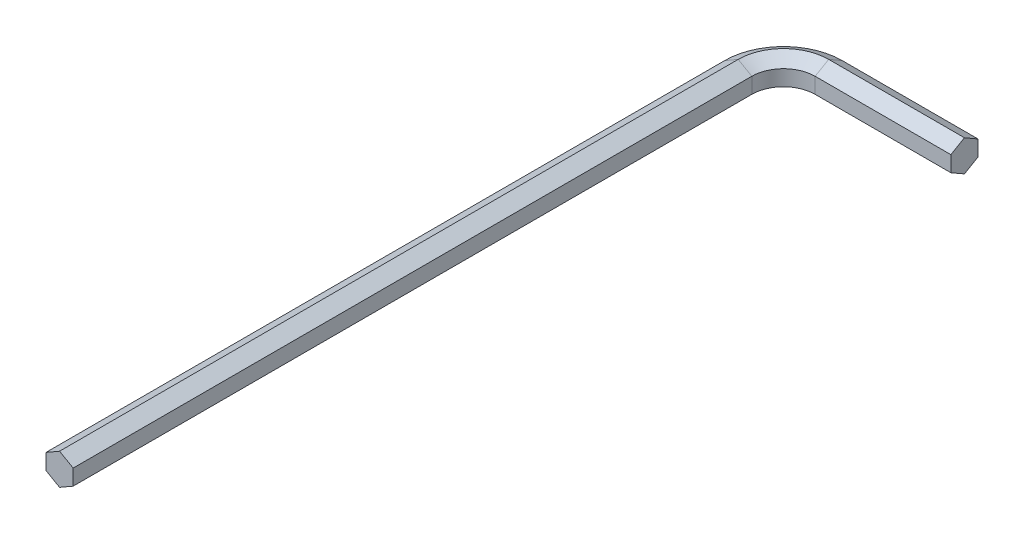
ISO-10303-21;
HEADER;
FILE_DESCRIPTION(('STEP AP214'),'2;1');
FILE_NAME('part.step','',(''),(''),'','','');
FILE_SCHEMA(('AUTOMOTIVE_DESIGN { 1 0 10303 214 1 1 1 1 }'));
ENDSEC;
DATA;
#1=APPLICATION_CONTEXT('core data for automotive mechanical design processes');
#2=APPLICATION_PROTOCOL_DEFINITION('international standard','automotive_design',2000,#1);
#3=PRODUCT_CONTEXT('',#1,'mechanical');
#4=PRODUCT('Part','Part','',(#3));
#5=PRODUCT_RELATED_PRODUCT_CATEGORY('part','',(#4));
#6=PRODUCT_DEFINITION_FORMATION('','',#4);
#7=PRODUCT_DEFINITION_CONTEXT('part definition',#1,'design');
#8=PRODUCT_DEFINITION('design','',#6,#7);
#9=PRODUCT_DEFINITION_SHAPE('','',#8);
#10=(LENGTH_UNIT() NAMED_UNIT(*) SI_UNIT(.MILLI.,.METRE.));
#11=(NAMED_UNIT(*) PLANE_ANGLE_UNIT() SI_UNIT($,.RADIAN.));
#12=(NAMED_UNIT(*) SI_UNIT($,.STERADIAN.) SOLID_ANGLE_UNIT());
#13=UNCERTAINTY_MEASURE_WITH_UNIT(LENGTH_MEASURE(1.E-05),#10,'distance_accuracy_value','');
#14=(GEOMETRIC_REPRESENTATION_CONTEXT(3) GLOBAL_UNCERTAINTY_ASSIGNED_CONTEXT((#13)) GLOBAL_UNIT_ASSIGNED_CONTEXT((#10,
#11,#12)) REPRESENTATION_CONTEXT('',''));
#15=CARTESIAN_POINT('',(0.,0.,0.));
#16=DIRECTION('',(0.,0.,1.));
#17=DIRECTION('',(1.,0.,0.));
#18=AXIS2_PLACEMENT_3D('',#15,#16,#17);
#19=CARTESIAN_POINT('',(5.,0.866025403784438,-78.5));
#20=DIRECTION('',(0.,-0.866025403784438,-0.5));
#21=DIRECTION('',(0.,0.5,-0.866025403784439));
#22=AXIS2_PLACEMENT_3D('',#19,#20,#21);
#23=PLANE('',#22);
#24=DIRECTION('',(0.,0.5,-0.866025403784438));
#25=VECTOR('',#24,1.);
#26=CARTESIAN_POINT('',(5.,0.866025403784438,-78.5));
#27=LINE('',#26,#25);
#28=CARTESIAN_POINT('',(5.,0.866025403784438,-78.5));
#29=VERTEX_POINT('',#28);
#30=CARTESIAN_POINT('',(5.,1.73205080756888,-80.));
#31=VERTEX_POINT('',#30);
#32=EDGE_CURVE('E161',#29,#31,#27,.T.);
#33=ORIENTED_EDGE('',*,*,#32,.F.);
#34=DIRECTION('',(1.,0.,0.));
#35=VECTOR('',#34,1.);
#36=CARTESIAN_POINT('',(5.,0.866025403784438,-78.5));
#37=LINE('',#36,#35);
#38=CARTESIAN_POINT('',(20.,0.866025403784438,-78.5));
#39=VERTEX_POINT('',#38);
#40=EDGE_CURVE('E47',#29,#39,#37,.T.);
#41=ORIENTED_EDGE('',*,*,#40,.T.);
#42=DIRECTION('',(0.,0.5,-0.866025403784438));
#43=VECTOR('',#42,1.);
#44=CARTESIAN_POINT('',(20.,0.866025403784438,-78.5));
#45=LINE('',#44,#43);
#46=CARTESIAN_POINT('',(20.,1.73205080756888,-80.));
#47=VERTEX_POINT('',#46);
#48=EDGE_CURVE('E57',#39,#47,#45,.T.);
#49=ORIENTED_EDGE('',*,*,#48,.T.);
#50=DIRECTION('',(1.,0.,0.));
#51=VECTOR('',#50,1.);
#52=CARTESIAN_POINT('',(5.,1.73205080756888,-80.));
#53=LINE('',#52,#51);
#54=EDGE_CURVE('E11',#31,#47,#53,.T.);
#55=ORIENTED_EDGE('',*,*,#54,.F.);
#56=EDGE_LOOP('',(#33,#41,#49,#55));
#57=FACE_BOUND('',#56,.T.);
#58=ADVANCED_FACE('F39',(#57),#23,.F.);
#59=CARTESIAN_POINT('',(5.,-0.866025403784439,-78.5));
#60=DIRECTION('',(0.,0.,-1.));
#61=DIRECTION('',(0.,1.,0.));
#62=AXIS2_PLACEMENT_3D('',#59,#60,#61);
#63=PLANE('',#62);
#64=DIRECTION('',(0.,1.,0.));
#65=VECTOR('',#64,1.);
#66=CARTESIAN_POINT('',(5.,-0.866025403784439,-78.5));
#67=LINE('',#66,#65);
#68=CARTESIAN_POINT('',(5.,-0.866025403784439,-78.5));
#69=VERTEX_POINT('',#68);
#70=EDGE_CURVE('E247',#69,#29,#67,.T.);
#71=ORIENTED_EDGE('',*,*,#70,.F.);
#72=DIRECTION('',(1.,0.,0.));
#73=VECTOR('',#72,1.);
#74=CARTESIAN_POINT('',(5.,-0.866025403784439,-78.5));
#75=LINE('',#74,#73);
#76=CARTESIAN_POINT('',(20.,-0.866025403784439,-78.5));
#77=VERTEX_POINT('',#76);
#78=EDGE_CURVE('E297',#69,#77,#75,.T.);
#79=ORIENTED_EDGE('',*,*,#78,.T.);
#80=DIRECTION('',(0.,1.,0.));
#81=VECTOR('',#80,1.);
#82=CARTESIAN_POINT('',(20.,-0.866025403784439,-78.5));
#83=LINE('',#82,#81);
#84=EDGE_CURVE('E65',#77,#39,#83,.T.);
#85=ORIENTED_EDGE('',*,*,#84,.T.);
#86=ORIENTED_EDGE('',*,*,#40,.F.);
#87=EDGE_LOOP('',(#71,#79,#85,#86));
#88=FACE_BOUND('',#87,.T.);
#89=ADVANCED_FACE('F302',(#88),#63,.F.);
#90=CARTESIAN_POINT('',(5.,-1.73205080756888,-80.));
#91=DIRECTION('',(0.,0.866025403784439,-0.5));
#92=DIRECTION('',(0.,0.5,0.866025403784439));
#93=AXIS2_PLACEMENT_3D('',#90,#91,#92);
#94=PLANE('',#93);
#95=DIRECTION('',(0.,0.5,0.866025403784439));
#96=VECTOR('',#95,1.);
#97=CARTESIAN_POINT('',(5.,-1.73205080756888,-80.));
#98=LINE('',#97,#96);
#99=CARTESIAN_POINT('',(5.,-1.73205080756888,-80.));
#100=VERTEX_POINT('',#99);
#101=EDGE_CURVE('E243',#100,#69,#98,.T.);
#102=ORIENTED_EDGE('',*,*,#101,.F.);
#103=DIRECTION('',(1.,0.,0.));
#104=VECTOR('',#103,1.);
#105=CARTESIAN_POINT('',(5.,-1.73205080756888,-80.));
#106=LINE('',#105,#104);
#107=CARTESIAN_POINT('',(20.,-1.73205080756888,-80.));
#108=VERTEX_POINT('',#107);
#109=EDGE_CURVE('E293',#100,#108,#106,.T.);
#110=ORIENTED_EDGE('',*,*,#109,.T.);
#111=DIRECTION('',(0.,0.5,0.866025403784439));
#112=VECTOR('',#111,1.);
#113=CARTESIAN_POINT('',(20.,-1.73205080756888,-80.));
#114=LINE('',#113,#112);
#115=EDGE_CURVE('E278',#108,#77,#114,.T.);
#116=ORIENTED_EDGE('',*,*,#115,.T.);
#117=ORIENTED_EDGE('',*,*,#78,.F.);
#118=EDGE_LOOP('',(#102,#110,#116,#117));
#119=FACE_BOUND('',#118,.T.);
#120=ADVANCED_FACE('F337',(#119),#94,.F.);
#121=CARTESIAN_POINT('',(5.,-0.866025403784438,-81.5));
#122=DIRECTION('',(0.,0.866025403784438,0.5));
#123=DIRECTION('',(0.,-0.5,0.866025403784438));
#124=AXIS2_PLACEMENT_3D('',#121,#122,#123);
#125=PLANE('',#124);
#126=DIRECTION('',(0.,-0.5,0.866025403784438));
#127=VECTOR('',#126,1.);
#128=CARTESIAN_POINT('',(5.,-0.866025403784438,-81.5));
#129=LINE('',#128,#127);
#130=CARTESIAN_POINT('',(5.,-0.866025403784438,-81.5));
#131=VERTEX_POINT('',#130);
#132=EDGE_CURVE('E239',#131,#100,#129,.T.);
#133=ORIENTED_EDGE('',*,*,#132,.F.);
#134=DIRECTION('',(1.,0.,0.));
#135=VECTOR('',#134,1.);
#136=CARTESIAN_POINT('',(5.,-0.866025403784438,-81.5));
#137=LINE('',#136,#135);
#138=CARTESIAN_POINT('',(20.,-0.866025403784438,-81.5));
#139=VERTEX_POINT('',#138);
#140=EDGE_CURVE('E289',#131,#139,#137,.T.);
#141=ORIENTED_EDGE('',*,*,#140,.T.);
#142=DIRECTION('',(0.,-0.5,0.866025403784438));
#143=VECTOR('',#142,1.);
#144=CARTESIAN_POINT('',(20.,-0.866025403784438,-81.5));
#145=LINE('',#144,#143);
#146=EDGE_CURVE('E275',#139,#108,#145,.T.);
#147=ORIENTED_EDGE('',*,*,#146,.T.);
#148=ORIENTED_EDGE('',*,*,#109,.F.);
#149=EDGE_LOOP('',(#133,#141,#147,#148));
#150=FACE_BOUND('',#149,.T.);
#151=ADVANCED_FACE('F328',(#150),#125,.F.);
#152=CARTESIAN_POINT('',(5.,0.866025403784438,-81.5));
#153=DIRECTION('',(0.,0.,1.));
#154=DIRECTION('',(0.,-1.,0.));
#155=AXIS2_PLACEMENT_3D('',#152,#153,#154);
#156=PLANE('',#155);
#157=DIRECTION('',(0.,-1.,0.));
#158=VECTOR('',#157,1.);
#159=CARTESIAN_POINT('',(5.,0.866025403784438,-81.5));
#160=LINE('',#159,#158);
#161=CARTESIAN_POINT('',(5.,0.866025403784438,-81.5));
#162=VERTEX_POINT('',#161);
#163=EDGE_CURVE('E236',#162,#131,#160,.T.);
#164=ORIENTED_EDGE('',*,*,#163,.F.);
#165=DIRECTION('',(1.,0.,0.));
#166=VECTOR('',#165,1.);
#167=CARTESIAN_POINT('',(5.,0.866025403784438,-81.5));
#168=LINE('',#167,#166);
#169=CARTESIAN_POINT('',(20.,0.866025403784438,-81.5));
#170=VERTEX_POINT('',#169);
#171=EDGE_CURVE('E285',#162,#170,#168,.T.);
#172=ORIENTED_EDGE('',*,*,#171,.T.);
#173=DIRECTION('',(0.,-1.,0.));
#174=VECTOR('',#173,1.);
#175=CARTESIAN_POINT('',(20.,0.866025403784438,-81.5));
#176=LINE('',#175,#174);
#177=EDGE_CURVE('E272',#170,#139,#176,.T.);
#178=ORIENTED_EDGE('',*,*,#177,.T.);
#179=ORIENTED_EDGE('',*,*,#140,.F.);
#180=EDGE_LOOP('',(#164,#172,#178,#179));
#181=FACE_BOUND('',#180,.T.);
#182=ADVANCED_FACE('F331',(#181),#156,.F.);
#183=CARTESIAN_POINT('',(5.,1.73205080756888,-80.));
#184=DIRECTION('',(0.,-0.866025403784439,0.5));
#185=DIRECTION('',(0.,-0.5,-0.866025403784439));
#186=AXIS2_PLACEMENT_3D('',#183,#184,#185);
#187=PLANE('',#186);
#188=DIRECTION('',(0.,-0.5,-0.866025403784439));
#189=VECTOR('',#188,1.);
#190=CARTESIAN_POINT('',(5.,1.73205080756888,-80.));
#191=LINE('',#190,#189);
#192=EDGE_CURVE('E156',#31,#162,#191,.T.);
#193=ORIENTED_EDGE('',*,*,#192,.F.);
#194=ORIENTED_EDGE('',*,*,#54,.T.);
#195=DIRECTION('',(0.,-0.5,-0.866025403784439));
#196=VECTOR('',#195,1.);
#197=CARTESIAN_POINT('',(20.,1.73205080756888,-80.));
#198=LINE('',#197,#196);
#199=EDGE_CURVE('E269',#47,#170,#198,.T.);
#200=ORIENTED_EDGE('',*,*,#199,.T.);
#201=ORIENTED_EDGE('',*,*,#171,.F.);
#202=EDGE_LOOP('',(#193,#194,#200,#201));
#203=FACE_BOUND('',#202,.T.);
#204=ADVANCED_FACE('F371',(#203),#187,.F.);
#205=CARTESIAN_POINT('',(5.,0.866025403784438,-75.));
#206=DIRECTION('',(0.,1.,0.));
#207=DIRECTION('',(0.,0.,1.));
#208=AXIS2_PLACEMENT_3D('',#205,#206,#207);
#209=CONICAL_SURFACE('',#208,3.5,1.0471975511966);
#210=DIRECTION('',(-0.866025403784438,0.5,0.));
#211=VECTOR('',#210,1.);
#212=CARTESIAN_POINT('',(1.5,0.866025403784438,-75.));
#213=LINE('',#212,#211);
#214=CARTESIAN_POINT('',(1.5,0.866025403784438,-75.));
#215=VERTEX_POINT('',#214);
#216=CARTESIAN_POINT('',(0.,1.73205080756888,-75.));
#217=VERTEX_POINT('',#216);
#218=EDGE_CURVE('E183',#215,#217,#213,.T.);
#219=ORIENTED_EDGE('',*,*,#218,.F.);
#220=CARTESIAN_POINT('',(5.,0.866025403784438,-75.));
#221=DIRECTION('',(0.,-1.,0.));
#222=DIRECTION('',(0.,0.,-1.));
#223=AXIS2_PLACEMENT_3D('',#220,#221,#222);
#224=CIRCLE('',#223,3.5);
#225=EDGE_CURVE('E263',#215,#29,#224,.T.);
#226=ORIENTED_EDGE('',*,*,#225,.T.);
#227=ORIENTED_EDGE('',*,*,#32,.T.);
#228=CARTESIAN_POINT('',(5.,1.73205080756888,-75.));
#229=DIRECTION('',(0.,-1.,0.));
#230=DIRECTION('',(0.,0.,-1.));
#231=AXIS2_PLACEMENT_3D('',#228,#229,#230);
#232=CIRCLE('',#231,5.);
#233=EDGE_CURVE('E267',#217,#31,#232,.T.);
#234=ORIENTED_EDGE('',*,*,#233,.F.);
#235=EDGE_LOOP('',(#219,#226,#227,#234));
#236=FACE_BOUND('',#235,.T.);
#237=ADVANCED_FACE('F380',(#236),#209,.F.);
#238=CARTESIAN_POINT('',(5.,0.,-75.));
#239=DIRECTION('',(0.,-1.,0.));
#240=DIRECTION('',(0.,0.,-1.));
#241=AXIS2_PLACEMENT_3D('',#238,#239,#240);
#242=CYLINDRICAL_SURFACE('',#241,3.5);
#243=DIRECTION('',(0.,1.,0.));
#244=VECTOR('',#243,1.);
#245=CARTESIAN_POINT('',(1.5,-0.866025403784439,-75.));
#246=LINE('',#245,#244);
#247=CARTESIAN_POINT('',(1.5,-0.866025403784439,-75.));
#248=VERTEX_POINT('',#247);
#249=EDGE_CURVE('E204',#248,#215,#246,.T.);
#250=ORIENTED_EDGE('',*,*,#249,.F.);
#251=CARTESIAN_POINT('',(5.,-0.866025403784439,-75.));
#252=DIRECTION('',(0.,-1.,0.));
#253=DIRECTION('',(0.,0.,-1.));
#254=AXIS2_PLACEMENT_3D('',#251,#252,#253);
#255=CIRCLE('',#254,3.5);
#256=EDGE_CURVE('E259',#248,#69,#255,.T.);
#257=ORIENTED_EDGE('',*,*,#256,.T.);
#258=ORIENTED_EDGE('',*,*,#70,.T.);
#259=ORIENTED_EDGE('',*,*,#225,.F.);
#260=EDGE_LOOP('',(#250,#257,#258,#259));
#261=FACE_BOUND('',#260,.T.);
#262=ADVANCED_FACE('F310',(#261),#242,.F.);
#263=CARTESIAN_POINT('',(5.,-1.73205080756888,-75.));
#264=DIRECTION('',(0.,-1.,0.));
#265=DIRECTION('',(0.,0.,-1.));
#266=AXIS2_PLACEMENT_3D('',#263,#264,#265);
#267=CONICAL_SURFACE('',#266,5.,1.0471975511966);
#268=DIRECTION('',(0.866025403784439,0.5,0.));
#269=VECTOR('',#268,1.);
#270=CARTESIAN_POINT('',(0.,-1.73205080756888,-75.));
#271=LINE('',#270,#269);
#272=CARTESIAN_POINT('',(0.,-1.73205080756888,-75.));
#273=VERTEX_POINT('',#272);
#274=EDGE_CURVE('E200',#273,#248,#271,.T.);
#275=ORIENTED_EDGE('',*,*,#274,.F.);
#276=CARTESIAN_POINT('',(5.,-1.73205080756888,-75.));
#277=DIRECTION('',(0.,-1.,0.));
#278=DIRECTION('',(0.,0.,-1.));
#279=AXIS2_PLACEMENT_3D('',#276,#277,#278);
#280=CIRCLE('',#279,5.);
#281=EDGE_CURVE('E255',#273,#100,#280,.T.);
#282=ORIENTED_EDGE('',*,*,#281,.T.);
#283=ORIENTED_EDGE('',*,*,#101,.T.);
#284=ORIENTED_EDGE('',*,*,#256,.F.);
#285=EDGE_LOOP('',(#275,#282,#283,#284));
#286=FACE_BOUND('',#285,.T.);
#287=ADVANCED_FACE('F307',(#286),#267,.F.);
#288=CARTESIAN_POINT('',(5.,-0.866025403784438,-75.));
#289=DIRECTION('',(0.,1.,0.));
#290=DIRECTION('',(0.,0.,1.));
#291=AXIS2_PLACEMENT_3D('',#288,#289,#290);
#292=CONICAL_SURFACE('',#291,6.5,1.0471975511966);
#293=DIRECTION('',(0.866025403784438,-0.5,0.));
#294=VECTOR('',#293,1.);
#295=CARTESIAN_POINT('',(-1.5,-0.866025403784438,-75.));
#296=LINE('',#295,#294);
#297=CARTESIAN_POINT('',(-1.5,-0.866025403784438,-75.));
#298=VERTEX_POINT('',#297);
#299=EDGE_CURVE('E171',#298,#273,#296,.T.);
#300=ORIENTED_EDGE('',*,*,#299,.F.);
#301=CARTESIAN_POINT('',(5.,-0.866025403784438,-75.));
#302=DIRECTION('',(0.,-1.,0.));
#303=DIRECTION('',(0.,0.,-1.));
#304=AXIS2_PLACEMENT_3D('',#301,#302,#303);
#305=CIRCLE('',#304,6.5);
#306=EDGE_CURVE('E160',#298,#131,#305,.T.);
#307=ORIENTED_EDGE('',*,*,#306,.T.);
#308=ORIENTED_EDGE('',*,*,#132,.T.);
#309=ORIENTED_EDGE('',*,*,#281,.F.);
#310=EDGE_LOOP('',(#300,#307,#308,#309));
#311=FACE_BOUND('',#310,.T.);
#312=ADVANCED_FACE('F325',(#311),#292,.T.);
#313=CARTESIAN_POINT('',(5.,0.,-75.));
#314=DIRECTION('',(0.,-1.,0.));
#315=DIRECTION('',(0.,0.,-1.));
#316=AXIS2_PLACEMENT_3D('',#313,#314,#315);
#317=CYLINDRICAL_SURFACE('',#316,6.5);
#318=DIRECTION('',(0.,-1.,0.));
#319=VECTOR('',#318,1.);
#320=CARTESIAN_POINT('',(-1.5,0.866025403784438,-75.));
#321=LINE('',#320,#319);
#322=CARTESIAN_POINT('',(-1.5,0.866025403784438,-75.));
#323=VERTEX_POINT('',#322);
#324=EDGE_CURVE('E164',#323,#298,#321,.T.);
#325=ORIENTED_EDGE('',*,*,#324,.F.);
#326=CARTESIAN_POINT('',(5.,0.866025403784438,-75.));
#327=DIRECTION('',(0.,-1.,0.));
#328=DIRECTION('',(0.,0.,-1.));
#329=AXIS2_PLACEMENT_3D('',#326,#327,#328);
#330=CIRCLE('',#329,6.5);
#331=EDGE_CURVE('E148',#323,#162,#330,.T.);
#332=ORIENTED_EDGE('',*,*,#331,.T.);
#333=ORIENTED_EDGE('',*,*,#163,.T.);
#334=ORIENTED_EDGE('',*,*,#306,.F.);
#335=EDGE_LOOP('',(#325,#332,#333,#334));
#336=FACE_BOUND('',#335,.T.);
#337=ADVANCED_FACE('F166',(#336),#317,.T.);
#338=CARTESIAN_POINT('',(5.,1.73205080756888,-75.));
#339=DIRECTION('',(0.,-1.,0.));
#340=DIRECTION('',(0.,0.,-1.));
#341=AXIS2_PLACEMENT_3D('',#338,#339,#340);
#342=CONICAL_SURFACE('',#341,5.,1.0471975511966);
#343=DIRECTION('',(-0.866025403784439,-0.5,0.));
#344=VECTOR('',#343,1.);
#345=CARTESIAN_POINT('',(0.,1.73205080756888,-75.));
#346=LINE('',#345,#344);
#347=EDGE_CURVE('E153',#217,#323,#346,.T.);
#348=ORIENTED_EDGE('',*,*,#347,.F.);
#349=ORIENTED_EDGE('',*,*,#233,.T.);
#350=ORIENTED_EDGE('',*,*,#192,.T.);
#351=ORIENTED_EDGE('',*,*,#331,.F.);
#352=EDGE_LOOP('',(#348,#349,#350,#351));
#353=FACE_BOUND('',#352,.T.);
#354=ADVANCED_FACE('F150',(#353),#342,.T.);
#355=CARTESIAN_POINT('',(0.,1.73205080756888,-75.));
#356=DIRECTION('',(-0.5,0.866025403784439,0.));
#357=DIRECTION('',(-0.866025403784439,-0.5,0.));
#358=AXIS2_PLACEMENT_3D('',#355,#356,#357);
#359=PLANE('',#358);
#360=DIRECTION('',(-0.866025403784439,-0.5,0.));
#361=VECTOR('',#360,1.);
#362=CARTESIAN_POINT('',(0.,1.73205080756888,0.));
#363=LINE('',#362,#361);
#364=CARTESIAN_POINT('',(0.,1.73205080756888,0.));
#365=VERTEX_POINT('',#364);
#366=CARTESIAN_POINT('',(-1.5,0.866025403784438,0.));
#367=VERTEX_POINT('',#366);
#368=EDGE_CURVE('E210',#365,#367,#363,.T.);
#369=ORIENTED_EDGE('',*,*,#368,.F.);
#370=DIRECTION('',(0.,0.,1.));
#371=VECTOR('',#370,1.);
#372=CARTESIAN_POINT('',(0.,1.73205080756888,-75.));
#373=LINE('',#372,#371);
#374=EDGE_CURVE('E186',#217,#365,#373,.T.);
#375=ORIENTED_EDGE('',*,*,#374,.F.);
#376=ORIENTED_EDGE('',*,*,#347,.T.);
#377=DIRECTION('',(0.,0.,1.));
#378=VECTOR('',#377,1.);
#379=CARTESIAN_POINT('',(-1.5,0.866025403784438,-75.));
#380=LINE('',#379,#378);
#381=EDGE_CURVE('E174',#323,#367,#380,.T.);
#382=ORIENTED_EDGE('',*,*,#381,.T.);
#383=EDGE_LOOP('',(#369,#375,#376,#382));
#384=FACE_BOUND('',#383,.T.);
#385=ADVANCED_FACE('F185',(#384),#359,.T.);
#386=CARTESIAN_POINT('',(1.5,0.866025403784438,-75.));
#387=DIRECTION('',(0.5,0.866025403784438,0.));
#388=DIRECTION('',(-0.866025403784439,0.5,0.));
#389=AXIS2_PLACEMENT_3D('',#386,#387,#388);
#390=PLANE('',#389);
#391=DIRECTION('',(-0.866025403784438,0.5,0.));
#392=VECTOR('',#391,1.);
#393=CARTESIAN_POINT('',(1.5,0.866025403784438,0.));
#394=LINE('',#393,#392);
#395=CARTESIAN_POINT('',(1.5,0.866025403784438,0.));
#396=VERTEX_POINT('',#395);
#397=EDGE_CURVE('E189',#396,#365,#394,.T.);
#398=ORIENTED_EDGE('',*,*,#397,.F.);
#399=DIRECTION('',(0.,0.,1.));
#400=VECTOR('',#399,1.);
#401=CARTESIAN_POINT('',(1.5,0.866025403784438,-75.));
#402=LINE('',#401,#400);
#403=EDGE_CURVE('E223',#215,#396,#402,.T.);
#404=ORIENTED_EDGE('',*,*,#403,.F.);
#405=ORIENTED_EDGE('',*,*,#218,.T.);
#406=ORIENTED_EDGE('',*,*,#374,.T.);
#407=EDGE_LOOP('',(#398,#404,#405,#406));
#408=FACE_BOUND('',#407,.T.);
#409=ADVANCED_FACE('F439',(#408),#390,.T.);
#410=CARTESIAN_POINT('',(1.5,-0.866025403784439,-75.));
#411=DIRECTION('',(1.,0.,0.));
#412=DIRECTION('',(0.,1.,0.));
#413=AXIS2_PLACEMENT_3D('',#410,#411,#412);
#414=PLANE('',#413);
#415=DIRECTION('',(0.,1.,0.));
#416=VECTOR('',#415,1.);
#417=CARTESIAN_POINT('',(1.5,-0.866025403784439,0.));
#418=LINE('',#417,#416);
#419=CARTESIAN_POINT('',(1.5,-0.866025403784439,0.));
#420=VERTEX_POINT('',#419);
#421=EDGE_CURVE('E194',#420,#396,#418,.T.);
#422=ORIENTED_EDGE('',*,*,#421,.F.);
#423=DIRECTION('',(0.,0.,1.));
#424=VECTOR('',#423,1.);
#425=CARTESIAN_POINT('',(1.5,-0.866025403784439,-75.));
#426=LINE('',#425,#424);
#427=EDGE_CURVE('E226',#248,#420,#426,.T.);
#428=ORIENTED_EDGE('',*,*,#427,.F.);
#429=ORIENTED_EDGE('',*,*,#249,.T.);
#430=ORIENTED_EDGE('',*,*,#403,.T.);
#431=EDGE_LOOP('',(#422,#428,#429,#430));
#432=FACE_BOUND('',#431,.T.);
#433=ADVANCED_FACE('F315',(#432),#414,.T.);
#434=CARTESIAN_POINT('',(0.,-1.73205080756888,-75.));
#435=DIRECTION('',(0.5,-0.866025403784439,0.));
#436=DIRECTION('',(0.866025403784439,0.5,0.));
#437=AXIS2_PLACEMENT_3D('',#434,#435,#436);
#438=PLANE('',#437);
#439=DIRECTION('',(0.866025403784439,0.5,0.));
#440=VECTOR('',#439,1.);
#441=CARTESIAN_POINT('',(0.,-1.73205080756888,0.));
#442=LINE('',#441,#440);
#443=CARTESIAN_POINT('',(0.,-1.73205080756888,0.));
#444=VERTEX_POINT('',#443);
#445=EDGE_CURVE('E216',#444,#420,#442,.T.);
#446=ORIENTED_EDGE('',*,*,#445,.F.);
#447=DIRECTION('',(0.,0.,1.));
#448=VECTOR('',#447,1.);
#449=CARTESIAN_POINT('',(0.,-1.73205080756888,-75.));
#450=LINE('',#449,#448);
#451=EDGE_CURVE('E229',#273,#444,#450,.T.);
#452=ORIENTED_EDGE('',*,*,#451,.F.);
#453=ORIENTED_EDGE('',*,*,#274,.T.);
#454=ORIENTED_EDGE('',*,*,#427,.T.);
#455=EDGE_LOOP('',(#446,#452,#453,#454));
#456=FACE_BOUND('',#455,.T.);
#457=ADVANCED_FACE('F319',(#456),#438,.T.);
#458=CARTESIAN_POINT('',(-1.5,-0.866025403784438,-75.));
#459=DIRECTION('',(-0.5,-0.866025403784438,0.));
#460=DIRECTION('',(0.866025403784439,-0.5,0.));
#461=AXIS2_PLACEMENT_3D('',#458,#459,#460);
#462=PLANE('',#461);
#463=DIRECTION('',(0.866025403784438,-0.5,0.));
#464=VECTOR('',#463,1.);
#465=CARTESIAN_POINT('',(-1.5,-0.866025403784438,0.));
#466=LINE('',#465,#464);
#467=CARTESIAN_POINT('',(-1.5,-0.866025403784438,0.));
#468=VERTEX_POINT('',#467);
#469=EDGE_CURVE('E213',#468,#444,#466,.T.);
#470=ORIENTED_EDGE('',*,*,#469,.F.);
#471=DIRECTION('',(0.,0.,1.));
#472=VECTOR('',#471,1.);
#473=CARTESIAN_POINT('',(-1.5,-0.866025403784438,-75.));
#474=LINE('',#473,#472);
#475=EDGE_CURVE('E182',#298,#468,#474,.T.);
#476=ORIENTED_EDGE('',*,*,#475,.F.);
#477=ORIENTED_EDGE('',*,*,#299,.T.);
#478=ORIENTED_EDGE('',*,*,#451,.T.);
#479=EDGE_LOOP('',(#470,#476,#477,#478));
#480=FACE_BOUND('',#479,.T.);
#481=ADVANCED_FACE('F323',(#480),#462,.T.);
#482=CARTESIAN_POINT('',(-1.5,0.866025403784438,-75.));
#483=DIRECTION('',(-1.,0.,0.));
#484=DIRECTION('',(0.,-1.,0.));
#485=AXIS2_PLACEMENT_3D('',#482,#483,#484);
#486=PLANE('',#485);
#487=DIRECTION('',(0.,-1.,0.));
#488=VECTOR('',#487,1.);
#489=CARTESIAN_POINT('',(-1.5,0.866025403784438,0.));
#490=LINE('',#489,#488);
#491=EDGE_CURVE('E177',#367,#468,#490,.T.);
#492=ORIENTED_EDGE('',*,*,#491,.F.);
#493=ORIENTED_EDGE('',*,*,#381,.F.);
#494=ORIENTED_EDGE('',*,*,#324,.T.);
#495=ORIENTED_EDGE('',*,*,#475,.T.);
#496=EDGE_LOOP('',(#492,#493,#494,#495));
#497=FACE_BOUND('',#496,.T.);
#498=ADVANCED_FACE('F175',(#497),#486,.T.);
#499=CARTESIAN_POINT('',(20.,0.,-80.));
#500=DIRECTION('',(-1.,0.,0.));
#501=DIRECTION('',(0.,0.,1.));
#502=AXIS2_PLACEMENT_3D('',#499,#500,#501);
#503=PLANE('',#502);
#504=ORIENTED_EDGE('',*,*,#199,.F.);
#505=ORIENTED_EDGE('',*,*,#48,.F.);
#506=ORIENTED_EDGE('',*,*,#84,.F.);
#507=ORIENTED_EDGE('',*,*,#115,.F.);
#508=ORIENTED_EDGE('',*,*,#146,.F.);
#509=ORIENTED_EDGE('',*,*,#177,.F.);
#510=EDGE_LOOP('',(#504,#505,#506,#507,#508,#509));
#511=FACE_BOUND('',#510,.T.);
#512=ADVANCED_FACE('F336',(#511),#503,.F.);
#513=CARTESIAN_POINT('',(0.,0.,0.));
#514=DIRECTION('',(0.,0.,1.));
#515=DIRECTION('',(1.,0.,0.));
#516=AXIS2_PLACEMENT_3D('',#513,#514,#515);
#517=PLANE('',#516);
#518=ORIENTED_EDGE('',*,*,#368,.T.);
#519=ORIENTED_EDGE('',*,*,#491,.T.);
#520=ORIENTED_EDGE('',*,*,#469,.T.);
#521=ORIENTED_EDGE('',*,*,#445,.T.);
#522=ORIENTED_EDGE('',*,*,#421,.T.);
#523=ORIENTED_EDGE('',*,*,#397,.T.);
#524=EDGE_LOOP('',(#518,#519,#520,#521,#522,#523));
#525=FACE_BOUND('',#524,.T.);
#526=ADVANCED_FACE('F489',(#525),#517,.T.);
#527=CLOSED_SHELL('',(#58,#89,#120,#151,#182,#204,#237,#262,#287,#312,#337,#354,#385,#409,#433,
#457,#481,#498,#512,#526));
#528=MANIFOLD_SOLID_BREP('B2',#527);
#529=ADVANCED_BREP_SHAPE_REPRESENTATION('',(#18,#528),#14);
#530=SHAPE_DEFINITION_REPRESENTATION(#9,#529);
ENDSEC;
END-ISO-10303-21;
